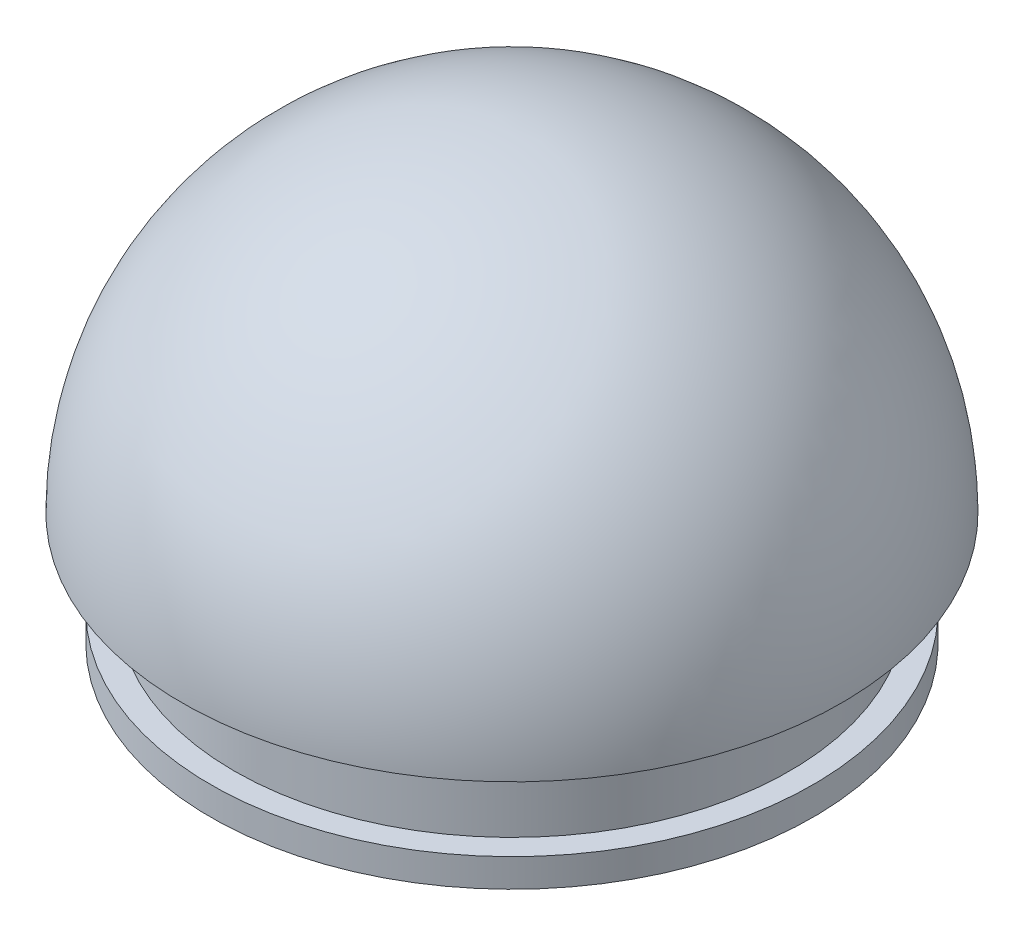
ISO-10303-21;
HEADER;
FILE_DESCRIPTION(('STEP AP214'),'2;1');
FILE_NAME('part.step','',(''),(''),'','','');
FILE_SCHEMA(('AUTOMOTIVE_DESIGN { 1 0 10303 214 1 1 1 1 }'));
ENDSEC;
DATA;
#1=APPLICATION_CONTEXT('core data for automotive mechanical design processes');
#2=APPLICATION_PROTOCOL_DEFINITION('international standard','automotive_design',2000,#1);
#3=PRODUCT_CONTEXT('',#1,'mechanical');
#4=PRODUCT('Part','Part','',(#3));
#5=PRODUCT_RELATED_PRODUCT_CATEGORY('part','',(#4));
#6=PRODUCT_DEFINITION_FORMATION('','',#4);
#7=PRODUCT_DEFINITION_CONTEXT('part definition',#1,'design');
#8=PRODUCT_DEFINITION('design','',#6,#7);
#9=PRODUCT_DEFINITION_SHAPE('','',#8);
#10=(LENGTH_UNIT() NAMED_UNIT(*) SI_UNIT(.MILLI.,.METRE.));
#11=(NAMED_UNIT(*) PLANE_ANGLE_UNIT() SI_UNIT($,.RADIAN.));
#12=(NAMED_UNIT(*) SI_UNIT($,.STERADIAN.) SOLID_ANGLE_UNIT());
#13=UNCERTAINTY_MEASURE_WITH_UNIT(LENGTH_MEASURE(1.E-05),#10,'distance_accuracy_value','');
#14=(GEOMETRIC_REPRESENTATION_CONTEXT(3) GLOBAL_UNCERTAINTY_ASSIGNED_CONTEXT((#13)) GLOBAL_UNIT_ASSIGNED_CONTEXT((#10,
#11,#12)) REPRESENTATION_CONTEXT('',''));
#15=CARTESIAN_POINT('',(0.,0.,0.));
#16=DIRECTION('',(0.,0.,1.));
#17=DIRECTION('',(1.,0.,0.));
#18=AXIS2_PLACEMENT_3D('',#15,#16,#17);
#19=CARTESIAN_POINT('',(0.,0.,0.));
#20=DIRECTION('',(0.0159054352945669,0.999873500562992,0.));
#21=DIRECTION('',(-0.999873500562992,0.0159054352945669,0.));
#22=AXIS2_PLACEMENT_3D('',#19,#20,#21);
#23=SPHERICAL_SURFACE('',#22,33.75);
#24=CARTESIAN_POINT('',(0.,0.,0.));
#25=DIRECTION('',(0.,1.,0.));
#26=DIRECTION('',(0.,0.,1.));
#27=AXIS2_PLACEMENT_3D('',#24,#25,#26);
#28=SPHERICAL_SURFACE('',#27,33.75);
#29=CARTESIAN_POINT('',(0.,3.,0.));
#30=DIRECTION('',(0.,1.,0.));
#31=DIRECTION('',(0.,0.,1.));
#32=AXIS2_PLACEMENT_3D('',#29,#30,#31);
#33=CIRCLE('',#32,33.6164022465225);
#34=CARTESIAN_POINT('',(0.,3.,33.6164022465225));
#35=VERTEX_POINT('',#34);
#36=EDGE_CURVE('E48',#35,#35,#33,.F.);
#37=ORIENTED_EDGE('',*,*,#36,.T.);
#38=EDGE_LOOP('',(#37));
#39=FACE_BOUND('',#38,.T.);
#40=ADVANCED_FACE('F33',(#39),#28,.F.);
#41=CARTESIAN_POINT('',(0.,3.,0.));
#42=DIRECTION('',(0.,1.,0.));
#43=DIRECTION('',(0.,0.,1.));
#44=AXIS2_PLACEMENT_3D('',#41,#42,#43);
#45=PLANE('',#44);
#46=CARTESIAN_POINT('',(0.,3.,0.));
#47=DIRECTION('',(0.,1.,0.));
#48=DIRECTION('',(0.,0.,1.));
#49=AXIS2_PLACEMENT_3D('',#46,#47,#48);
#50=CIRCLE('',#49,28.);
#51=CARTESIAN_POINT('',(0.,3.,28.));
#52=VERTEX_POINT('',#51);
#53=EDGE_CURVE('E37',#52,#52,#50,.T.);
#54=ORIENTED_EDGE('',*,*,#53,.F.);
#55=EDGE_LOOP('',(#54));
#56=FACE_BOUND('',#55,.T.);
#57=ORIENTED_EDGE('',*,*,#36,.F.);
#58=EDGE_LOOP('',(#57));
#59=FACE_BOUND('',#58,.T.);
#60=ADVANCED_FACE('F74',(#56,#59),#45,.T.);
#61=CARTESIAN_POINT('',(0.,3.9999,0.));
#62=DIRECTION('',(0.,-1.,0.));
#63=DIRECTION('',(0.,0.,-1.));
#64=AXIS2_PLACEMENT_3D('',#61,#62,#63);
#65=CYLINDRICAL_SURFACE('',#64,28.);
#66=ORIENTED_EDGE('',*,*,#53,.T.);
#67=EDGE_LOOP('',(#66));
#68=FACE_BOUND('',#67,.T.);
#69=CARTESIAN_POINT('',(0.,-12.0001,0.));
#70=DIRECTION('',(0.,-1.,0.));
#71=DIRECTION('',(0.,0.,-1.));
#72=AXIS2_PLACEMENT_3D('',#69,#70,#71);
#73=CIRCLE('',#72,28.);
#74=CARTESIAN_POINT('',(0.,-12.0001,-28.));
#75=VERTEX_POINT('',#74);
#76=EDGE_CURVE('E65',#75,#75,#73,.T.);
#77=ORIENTED_EDGE('',*,*,#76,.T.);
#78=EDGE_LOOP('',(#77));
#79=FACE_BOUND('',#78,.T.);
#80=ADVANCED_FACE('F72',(#68,#79),#65,.F.);
#81=CARTESIAN_POINT('',(0.,-12.0001,0.));
#82=DIRECTION('',(0.,1.,0.));
#83=DIRECTION('',(0.,0.,1.));
#84=AXIS2_PLACEMENT_3D('',#81,#82,#83);
#85=CYLINDRICAL_SURFACE('',#84,29.5);
#86=CARTESIAN_POINT('',(0.,-0.0001,0.));
#87=DIRECTION('',(0.,-1.,0.));
#88=DIRECTION('',(0.,0.,-1.));
#89=AXIS2_PLACEMENT_3D('',#86,#87,#88);
#90=CIRCLE('',#89,29.5);
#91=CARTESIAN_POINT('',(0.,-0.0001,-29.5));
#92=VERTEX_POINT('',#91);
#93=EDGE_CURVE('E41',#92,#92,#90,.T.);
#94=ORIENTED_EDGE('',*,*,#93,.T.);
#95=EDGE_LOOP('',(#94));
#96=FACE_BOUND('',#95,.T.);
#97=CARTESIAN_POINT('',(0.,-9.0001,0.));
#98=DIRECTION('',(0.,-1.,0.));
#99=DIRECTION('',(0.,0.,-1.));
#100=AXIS2_PLACEMENT_3D('',#97,#98,#99);
#101=CIRCLE('',#100,29.5);
#102=CARTESIAN_POINT('',(0.,-9.0001,-29.5));
#103=VERTEX_POINT('',#102);
#104=EDGE_CURVE('E10',#103,#103,#101,.T.);
#105=ORIENTED_EDGE('',*,*,#104,.F.);
#106=EDGE_LOOP('',(#105));
#107=FACE_BOUND('',#106,.T.);
#108=ADVANCED_FACE('F87',(#96,#107),#85,.T.);
#109=CARTESIAN_POINT('',(0.,0.,0.));
#110=DIRECTION('',(0.,-1.,0.));
#111=DIRECTION('',(0.,0.,-1.));
#112=AXIS2_PLACEMENT_3D('',#109,#110,#111);
#113=PLANE('',#112);
#114=CARTESIAN_POINT('',(0.,0.,0.));
#115=DIRECTION('',(0.,-1.,0.));
#116=DIRECTION('',(0.,0.,-1.));
#117=AXIS2_PLACEMENT_3D('',#114,#115,#116);
#118=CIRCLE('',#117,35.);
#119=CARTESIAN_POINT('',(0.,2.44403693719019E-13,-35.));
#120=VERTEX_POINT('',#119);
#121=EDGE_CURVE('E45',#120,#120,#118,.T.);
#122=ORIENTED_EDGE('',*,*,#121,.T.);
#123=EDGE_LOOP('',(#122));
#124=FACE_BOUND('',#123,.T.);
#125=CARTESIAN_POINT('',(0.,0.,0.));
#126=DIRECTION('',(0.,-1.,0.));
#127=DIRECTION('',(0.,0.,-1.));
#128=AXIS2_PLACEMENT_3D('',#125,#126,#127);
#129=CIRCLE('',#128,33.75);
#130=CARTESIAN_POINT('',(0.,2.35674990371912E-13,-33.75));
#131=VERTEX_POINT('',#130);
#132=EDGE_CURVE('E51',#131,#131,#129,.T.);
#133=ORIENTED_EDGE('',*,*,#132,.F.);
#134=EDGE_LOOP('',(#133));
#135=FACE_BOUND('',#134,.T.);
#136=ADVANCED_FACE('F84',(#124,#135),#113,.T.);
#137=CARTESIAN_POINT('',(0.,0.,0.));
#138=DIRECTION('',(1.,0.,0.));
#139=DIRECTION('',(0.,-1.,0.));
#140=AXIS2_PLACEMENT_3D('',#137,#138,#139);
#141=SPHERICAL_SURFACE('',#140,35.);
#142=CARTESIAN_POINT('',(0.,0.,0.));
#143=DIRECTION('',(0.,-1.,0.));
#144=DIRECTION('',(0.,0.,-1.));
#145=AXIS2_PLACEMENT_3D('',#142,#143,#144);
#146=SPHERICAL_SURFACE('',#145,35.);
#147=ORIENTED_EDGE('',*,*,#121,.F.);
#148=EDGE_LOOP('',(#147));
#149=FACE_BOUND('',#148,.T.);
#150=ADVANCED_FACE('F35',(#149),#146,.T.);
#151=CARTESIAN_POINT('',(0.,-0.0001,0.));
#152=DIRECTION('',(0.,1.,0.));
#153=DIRECTION('',(0.,0.,1.));
#154=AXIS2_PLACEMENT_3D('',#151,#152,#153);
#155=PLANE('',#154);
#156=ORIENTED_EDGE('',*,*,#93,.F.);
#157=EDGE_LOOP('',(#156));
#158=FACE_BOUND('',#157,.T.);
#159=CARTESIAN_POINT('',(0.,-0.0001,0.));
#160=DIRECTION('',(0.,1.,0.));
#161=DIRECTION('',(0.,0.,1.));
#162=AXIS2_PLACEMENT_3D('',#159,#160,#161);
#163=CIRCLE('',#162,33.75);
#164=CARTESIAN_POINT('',(0.,-0.0001,33.75));
#165=VERTEX_POINT('',#164);
#166=EDGE_CURVE('E56',#165,#165,#163,.T.);
#167=ORIENTED_EDGE('',*,*,#166,.F.);
#168=EDGE_LOOP('',(#167));
#169=FACE_BOUND('',#168,.T.);
#170=ADVANCED_FACE('F93',(#158,#169),#155,.F.);
#171=CARTESIAN_POINT('',(0.,-0.0001,0.));
#172=DIRECTION('',(0.,1.,0.));
#173=DIRECTION('',(0.,0.,1.));
#174=AXIS2_PLACEMENT_3D('',#171,#172,#173);
#175=CYLINDRICAL_SURFACE('',#174,33.75);
#176=ORIENTED_EDGE('',*,*,#132,.T.);
#177=EDGE_LOOP('',(#176));
#178=FACE_BOUND('',#177,.T.);
#179=ORIENTED_EDGE('',*,*,#166,.T.);
#180=EDGE_LOOP('',(#179));
#181=FACE_BOUND('',#180,.T.);
#182=ADVANCED_FACE('F89',(#178,#181),#175,.T.);
#183=CARTESIAN_POINT('',(0.,-9.0001,0.));
#184=DIRECTION('',(0.,-1.,0.));
#185=DIRECTION('',(0.,0.,-1.));
#186=AXIS2_PLACEMENT_3D('',#183,#184,#185);
#187=CYLINDRICAL_SURFACE('',#186,32.);
#188=CARTESIAN_POINT('',(0.,-9.0001,0.));
#189=DIRECTION('',(0.,-1.,0.));
#190=DIRECTION('',(0.,0.,-1.));
#191=AXIS2_PLACEMENT_3D('',#188,#189,#190);
#192=CIRCLE('',#191,32.);
#193=CARTESIAN_POINT('',(0.,-9.0001,-32.));
#194=VERTEX_POINT('',#193);
#195=EDGE_CURVE('E58',#194,#194,#192,.T.);
#196=ORIENTED_EDGE('',*,*,#195,.T.);
#197=EDGE_LOOP('',(#196));
#198=FACE_BOUND('',#197,.T.);
#199=CARTESIAN_POINT('',(0.,-12.0001,0.));
#200=DIRECTION('',(0.,-1.,0.));
#201=DIRECTION('',(0.,0.,-1.));
#202=AXIS2_PLACEMENT_3D('',#199,#200,#201);
#203=CIRCLE('',#202,32.);
#204=CARTESIAN_POINT('',(0.,-12.0001,-32.));
#205=VERTEX_POINT('',#204);
#206=EDGE_CURVE('E60',#205,#205,#203,.T.);
#207=ORIENTED_EDGE('',*,*,#206,.F.);
#208=EDGE_LOOP('',(#207));
#209=FACE_BOUND('',#208,.T.);
#210=ADVANCED_FACE('F92',(#198,#209),#187,.T.);
#211=CARTESIAN_POINT('',(0.,-9.0001,0.));
#212=DIRECTION('',(0.,-1.,0.));
#213=DIRECTION('',(0.,0.,-1.));
#214=AXIS2_PLACEMENT_3D('',#211,#212,#213);
#215=PLANE('',#214);
#216=ORIENTED_EDGE('',*,*,#104,.T.);
#217=EDGE_LOOP('',(#216));
#218=FACE_BOUND('',#217,.T.);
#219=ORIENTED_EDGE('',*,*,#195,.F.);
#220=EDGE_LOOP('',(#219));
#221=FACE_BOUND('',#220,.T.);
#222=ADVANCED_FACE('F104',(#218,#221),#215,.F.);
#223=CARTESIAN_POINT('',(0.,-12.0001,0.));
#224=DIRECTION('',(0.,-1.,0.));
#225=DIRECTION('',(0.,0.,-1.));
#226=AXIS2_PLACEMENT_3D('',#223,#224,#225);
#227=PLANE('',#226);
#228=ORIENTED_EDGE('',*,*,#76,.F.);
#229=EDGE_LOOP('',(#228));
#230=FACE_BOUND('',#229,.T.);
#231=ORIENTED_EDGE('',*,*,#206,.T.);
#232=EDGE_LOOP('',(#231));
#233=FACE_BOUND('',#232,.T.);
#234=ADVANCED_FACE('F101',(#230,#233),#227,.T.);
#235=CLOSED_SHELL('',(#40,#60,#80,#108,#136,#150,#170,#182,#210,#222,#234));
#236=MANIFOLD_SOLID_BREP('B2',#235);
#237=ADVANCED_BREP_SHAPE_REPRESENTATION('',(#18,#236),#14);
#238=SHAPE_DEFINITION_REPRESENTATION(#9,#237);
ENDSEC;
END-ISO-10303-21;
